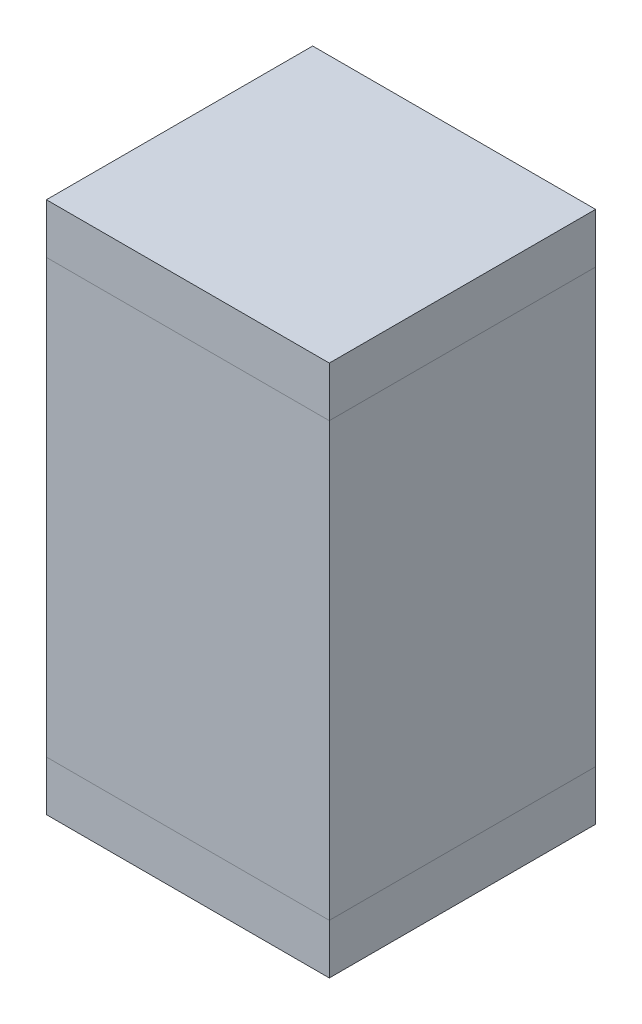
ISO-10303-21;
HEADER;
FILE_DESCRIPTION(('STEP AP214'),'2;1');
FILE_NAME('part.step','',(''),(''),'','','');
FILE_SCHEMA(('AUTOMOTIVE_DESIGN { 1 0 10303 214 1 1 1 1 }'));
ENDSEC;
DATA;
#1=APPLICATION_CONTEXT('core data for automotive mechanical design processes');
#2=APPLICATION_PROTOCOL_DEFINITION('international standard','automotive_design',2000,#1);
#3=PRODUCT_CONTEXT('',#1,'mechanical');
#4=PRODUCT('Part','Part','',(#3));
#5=PRODUCT_RELATED_PRODUCT_CATEGORY('part','',(#4));
#6=PRODUCT_DEFINITION_FORMATION('','',#4);
#7=PRODUCT_DEFINITION_CONTEXT('part definition',#1,'design');
#8=PRODUCT_DEFINITION('design','',#6,#7);
#9=PRODUCT_DEFINITION_SHAPE('','',#8);
#10=(LENGTH_UNIT() NAMED_UNIT(*) SI_UNIT(.MILLI.,.METRE.));
#11=(NAMED_UNIT(*) PLANE_ANGLE_UNIT() SI_UNIT($,.RADIAN.));
#12=(NAMED_UNIT(*) SI_UNIT($,.STERADIAN.) SOLID_ANGLE_UNIT());
#13=UNCERTAINTY_MEASURE_WITH_UNIT(LENGTH_MEASURE(1.E-05),#10,'distance_accuracy_value','');
#14=(GEOMETRIC_REPRESENTATION_CONTEXT(3) GLOBAL_UNCERTAINTY_ASSIGNED_CONTEXT((#13)) GLOBAL_UNIT_ASSIGNED_CONTEXT((#10,
#11,#12)) REPRESENTATION_CONTEXT('',''));
#15=CARTESIAN_POINT('',(0.,0.,0.));
#16=DIRECTION('',(0.,0.,1.));
#17=DIRECTION('',(1.,0.,0.));
#18=AXIS2_PLACEMENT_3D('',#15,#16,#17);
#19=CARTESIAN_POINT('',(0.,0.,0.));
#20=DIRECTION('',(0.,0.,1.));
#21=DIRECTION('',(1.,0.,0.));
#22=AXIS2_PLACEMENT_3D('',#19,#20,#21);
#23=PLANE('',#22);
#24=DIRECTION('',(1.,0.,0.));
#25=VECTOR('',#24,1.);
#26=CARTESIAN_POINT('',(-0.425,0.65,0.));
#27=LINE('',#26,#25);
#28=CARTESIAN_POINT('',(-0.425,0.65,0.));
#29=VERTEX_POINT('',#28);
#30=CARTESIAN_POINT('',(0.425,0.65,0.));
#31=VERTEX_POINT('',#30);
#32=EDGE_CURVE('P0_E20',#29,#31,#27,.T.);
#33=ORIENTED_EDGE('',*,*,#32,.T.);
#34=DIRECTION('',(0.,-1.,0.));
#35=VECTOR('',#34,1.);
#36=CARTESIAN_POINT('',(0.425,0.65,0.));
#37=LINE('',#36,#35);
#38=CARTESIAN_POINT('',(0.425,-0.65,0.));
#39=VERTEX_POINT('',#38);
#40=EDGE_CURVE('P0_E88',#31,#39,#37,.T.);
#41=ORIENTED_EDGE('',*,*,#40,.T.);
#42=DIRECTION('',(-1.,0.,0.));
#43=VECTOR('',#42,1.);
#44=CARTESIAN_POINT('',(0.425,-0.65,0.));
#45=LINE('',#44,#43);
#46=CARTESIAN_POINT('',(-0.425,-0.65,0.));
#47=VERTEX_POINT('',#46);
#48=EDGE_CURVE('P0_E70',#39,#47,#45,.T.);
#49=ORIENTED_EDGE('',*,*,#48,.T.);
#50=DIRECTION('',(0.,1.,0.));
#51=VECTOR('',#50,1.);
#52=CARTESIAN_POINT('',(-0.425,-0.65,0.));
#53=LINE('',#52,#51);
#54=EDGE_CURVE('P0_E109',#47,#29,#53,.T.);
#55=ORIENTED_EDGE('',*,*,#54,.T.);
#56=EDGE_LOOP('',(#33,#41,#49,#55));
#57=FACE_BOUND('',#56,.T.);
#58=ADVANCED_FACE('P0_F17',(#57),#23,.F.);
#59=CARTESIAN_POINT('',(0.,0.,0.8));
#60=DIRECTION('',(0.,0.,1.));
#61=DIRECTION('',(1.,0.,0.));
#62=AXIS2_PLACEMENT_3D('',#59,#60,#61);
#63=PLANE('',#62);
#64=DIRECTION('',(-1.,0.,0.));
#65=VECTOR('',#64,1.);
#66=CARTESIAN_POINT('',(-0.425,0.65,0.8));
#67=LINE('',#66,#65);
#68=CARTESIAN_POINT('',(0.425,0.65,0.8));
#69=VERTEX_POINT('',#68);
#70=CARTESIAN_POINT('',(-0.425,0.65,0.8));
#71=VERTEX_POINT('',#70);
#72=EDGE_CURVE('P0_E11',#69,#71,#67,.T.);
#73=ORIENTED_EDGE('',*,*,#72,.T.);
#74=DIRECTION('',(0.,-1.,0.));
#75=VECTOR('',#74,1.);
#76=CARTESIAN_POINT('',(-0.425,-0.65,0.8));
#77=LINE('',#76,#75);
#78=CARTESIAN_POINT('',(-0.425,-0.65,0.8));
#79=VERTEX_POINT('',#78);
#80=EDGE_CURVE('P0_E103',#71,#79,#77,.T.);
#81=ORIENTED_EDGE('',*,*,#80,.T.);
#82=DIRECTION('',(1.,0.,0.));
#83=VECTOR('',#82,1.);
#84=CARTESIAN_POINT('',(0.425,-0.65,0.8));
#85=LINE('',#84,#83);
#86=CARTESIAN_POINT('',(0.425,-0.65,0.8));
#87=VERTEX_POINT('',#86);
#88=EDGE_CURVE('P0_E82',#79,#87,#85,.T.);
#89=ORIENTED_EDGE('',*,*,#88,.T.);
#90=DIRECTION('',(0.,1.,0.));
#91=VECTOR('',#90,1.);
#92=CARTESIAN_POINT('',(0.425,0.65,0.8));
#93=LINE('',#92,#91);
#94=EDGE_CURVE('P0_E89',#87,#69,#93,.T.);
#95=ORIENTED_EDGE('',*,*,#94,.T.);
#96=EDGE_LOOP('',(#73,#81,#89,#95));
#97=FACE_BOUND('',#96,.T.);
#98=ADVANCED_FACE('P0_F118',(#97),#63,.T.);
#99=CARTESIAN_POINT('',(0.425,0.65,0.));
#100=DIRECTION('',(0.,1.,0.));
#101=DIRECTION('',(1.,0.,0.));
#102=AXIS2_PLACEMENT_3D('',#99,#100,#101);
#103=PLANE('',#102);
#104=ORIENTED_EDGE('',*,*,#32,.F.);
#105=DIRECTION('',(0.,0.,1.));
#106=VECTOR('',#105,1.);
#107=CARTESIAN_POINT('',(-0.425,0.65,0.));
#108=LINE('',#107,#106);
#109=EDGE_CURVE('P0_E101',#29,#71,#108,.T.);
#110=ORIENTED_EDGE('',*,*,#109,.T.);
#111=ORIENTED_EDGE('',*,*,#72,.F.);
#112=DIRECTION('',(0.,0.,1.));
#113=VECTOR('',#112,1.);
#114=CARTESIAN_POINT('',(0.425,0.65,0.));
#115=LINE('',#114,#113);
#116=EDGE_CURVE('P0_E93',#31,#69,#115,.T.);
#117=ORIENTED_EDGE('',*,*,#116,.F.);
#118=EDGE_LOOP('',(#104,#110,#111,#117));
#119=FACE_BOUND('',#118,.T.);
#120=ADVANCED_FACE('P0_F117',(#119),#103,.T.);
#121=CARTESIAN_POINT('',(-0.425,0.65,0.));
#122=DIRECTION('',(-1.,0.,0.));
#123=DIRECTION('',(0.,0.,1.));
#124=AXIS2_PLACEMENT_3D('',#121,#122,#123);
#125=PLANE('',#124);
#126=ORIENTED_EDGE('',*,*,#54,.F.);
#127=DIRECTION('',(0.,0.,1.));
#128=VECTOR('',#127,1.);
#129=CARTESIAN_POINT('',(-0.425,-0.65,0.));
#130=LINE('',#129,#128);
#131=EDGE_CURVE('P0_E77',#47,#79,#130,.T.);
#132=ORIENTED_EDGE('',*,*,#131,.T.);
#133=ORIENTED_EDGE('',*,*,#80,.F.);
#134=ORIENTED_EDGE('',*,*,#109,.F.);
#135=EDGE_LOOP('',(#126,#132,#133,#134));
#136=FACE_BOUND('',#135,.T.);
#137=ADVANCED_FACE('P0_F115',(#136),#125,.T.);
#138=CARTESIAN_POINT('',(-0.425,-0.65,0.));
#139=DIRECTION('',(0.,-1.,0.));
#140=DIRECTION('',(0.,0.,-1.));
#141=AXIS2_PLACEMENT_3D('',#138,#139,#140);
#142=PLANE('',#141);
#143=ORIENTED_EDGE('',*,*,#48,.F.);
#144=DIRECTION('',(0.,0.,1.));
#145=VECTOR('',#144,1.);
#146=CARTESIAN_POINT('',(0.425,-0.65,0.));
#147=LINE('',#146,#145);
#148=EDGE_CURVE('P0_E74',#39,#87,#147,.T.);
#149=ORIENTED_EDGE('',*,*,#148,.T.);
#150=ORIENTED_EDGE('',*,*,#88,.F.);
#151=ORIENTED_EDGE('',*,*,#131,.F.);
#152=EDGE_LOOP('',(#143,#149,#150,#151));
#153=FACE_BOUND('',#152,.T.);
#154=ADVANCED_FACE('P0_F72',(#153),#142,.T.);
#155=CARTESIAN_POINT('',(0.425,-0.65,0.));
#156=DIRECTION('',(1.,0.,0.));
#157=DIRECTION('',(0.,1.,0.));
#158=AXIS2_PLACEMENT_3D('',#155,#156,#157);
#159=PLANE('',#158);
#160=ORIENTED_EDGE('',*,*,#40,.F.);
#161=ORIENTED_EDGE('',*,*,#116,.T.);
#162=ORIENTED_EDGE('',*,*,#94,.F.);
#163=ORIENTED_EDGE('',*,*,#148,.F.);
#164=EDGE_LOOP('',(#160,#161,#162,#163));
#165=FACE_BOUND('',#164,.T.);
#166=ADVANCED_FACE('P0_F86',(#165),#159,.T.);
#167=CLOSED_SHELL('',(#58,#98,#120,#137,#154,#166));
#168=MANIFOLD_SOLID_BREP('P0_B1',#167);
#169=CARTESIAN_POINT('',(0.425,0.65,0.));
#170=DIRECTION('',(0.,1.,0.));
#171=DIRECTION('',(1.,0.,0.));
#172=AXIS2_PLACEMENT_3D('',#169,#170,#171);
#173=PLANE('',#172);
#174=DIRECTION('',(1.,0.,0.));
#175=VECTOR('',#174,1.);
#176=CARTESIAN_POINT('',(-0.425,0.65,0.));
#177=LINE('',#176,#175);
#178=CARTESIAN_POINT('',(-0.425,0.65,0.));
#179=VERTEX_POINT('',#178);
#180=CARTESIAN_POINT('',(0.425,0.65,0.));
#181=VERTEX_POINT('',#180);
#182=EDGE_CURVE('P1_E26',#179,#181,#177,.T.);
#183=ORIENTED_EDGE('',*,*,#182,.T.);
#184=DIRECTION('',(0.,0.,1.));
#185=VECTOR('',#184,1.);
#186=CARTESIAN_POINT('',(0.425,0.65,0.));
#187=LINE('',#186,#185);
#188=CARTESIAN_POINT('',(0.425,0.65,0.8));
#189=VERTEX_POINT('',#188);
#190=EDGE_CURVE('P1_E91',#181,#189,#187,.T.);
#191=ORIENTED_EDGE('',*,*,#190,.T.);
#192=DIRECTION('',(-1.,0.,0.));
#193=VECTOR('',#192,1.);
#194=CARTESIAN_POINT('',(-0.425,0.65,0.8));
#195=LINE('',#194,#193);
#196=CARTESIAN_POINT('',(-0.425,0.65,0.8));
#197=VERTEX_POINT('',#196);
#198=EDGE_CURVE('P1_E77',#189,#197,#195,.T.);
#199=ORIENTED_EDGE('',*,*,#198,.T.);
#200=DIRECTION('',(0.,0.,1.));
#201=VECTOR('',#200,1.);
#202=CARTESIAN_POINT('',(-0.425,0.65,0.));
#203=LINE('',#202,#201);
#204=EDGE_CURVE('P1_E56',#179,#197,#203,.T.);
#205=ORIENTED_EDGE('',*,*,#204,.F.);
#206=EDGE_LOOP('',(#183,#191,#199,#205));
#207=FACE_BOUND('',#206,.T.);
#208=ADVANCED_FACE('P1_F17',(#207),#173,.F.);
#209=CARTESIAN_POINT('',(0.425,0.8,0.));
#210=DIRECTION('',(0.,1.,0.));
#211=DIRECTION('',(1.,0.,0.));
#212=AXIS2_PLACEMENT_3D('',#209,#210,#211);
#213=PLANE('',#212);
#214=DIRECTION('',(-1.,0.,0.));
#215=VECTOR('',#214,1.);
#216=CARTESIAN_POINT('',(-0.425,0.8,0.));
#217=LINE('',#216,#215);
#218=CARTESIAN_POINT('',(0.425,0.8,0.));
#219=VERTEX_POINT('',#218);
#220=CARTESIAN_POINT('',(-0.425,0.8,0.));
#221=VERTEX_POINT('',#220);
#222=EDGE_CURVE('P1_E11',#219,#221,#217,.T.);
#223=ORIENTED_EDGE('',*,*,#222,.T.);
#224=DIRECTION('',(0.,0.,1.));
#225=VECTOR('',#224,1.);
#226=CARTESIAN_POINT('',(-0.425,0.8,0.));
#227=LINE('',#226,#225);
#228=CARTESIAN_POINT('',(-0.425,0.8,0.8));
#229=VERTEX_POINT('',#228);
#230=EDGE_CURVE('P1_E47',#221,#229,#227,.T.);
#231=ORIENTED_EDGE('',*,*,#230,.T.);
#232=DIRECTION('',(1.,0.,0.));
#233=VECTOR('',#232,1.);
#234=CARTESIAN_POINT('',(-0.425,0.8,0.8));
#235=LINE('',#234,#233);
#236=CARTESIAN_POINT('',(0.425,0.8,0.8));
#237=VERTEX_POINT('',#236);
#238=EDGE_CURVE('P1_E65',#229,#237,#235,.T.);
#239=ORIENTED_EDGE('',*,*,#238,.T.);
#240=DIRECTION('',(0.,0.,-1.));
#241=VECTOR('',#240,1.);
#242=CARTESIAN_POINT('',(0.425,0.8,0.));
#243=LINE('',#242,#241);
#244=EDGE_CURVE('P1_E92',#237,#219,#243,.T.);
#245=ORIENTED_EDGE('',*,*,#244,.T.);
#246=EDGE_LOOP('',(#223,#231,#239,#245));
#247=FACE_BOUND('',#246,.T.);
#248=ADVANCED_FACE('P1_F144',(#247),#213,.T.);
#249=CARTESIAN_POINT('',(0.425,0.65,0.));
#250=DIRECTION('',(0.,0.,-1.));
#251=DIRECTION('',(0.,-1.,0.));
#252=AXIS2_PLACEMENT_3D('',#249,#250,#251);
#253=PLANE('',#252);
#254=ORIENTED_EDGE('',*,*,#182,.F.);
#255=DIRECTION('',(0.,1.,0.));
#256=VECTOR('',#255,1.);
#257=CARTESIAN_POINT('',(-0.425,0.65,0.));
#258=LINE('',#257,#256);
#259=EDGE_CURVE('P1_E105',#179,#221,#258,.T.);
#260=ORIENTED_EDGE('',*,*,#259,.T.);
#261=ORIENTED_EDGE('',*,*,#222,.F.);
#262=DIRECTION('',(0.,1.,0.));
#263=VECTOR('',#262,1.);
#264=CARTESIAN_POINT('',(0.425,0.65,0.));
#265=LINE('',#264,#263);
#266=EDGE_CURVE('P1_E97',#181,#219,#265,.T.);
#267=ORIENTED_EDGE('',*,*,#266,.F.);
#268=EDGE_LOOP('',(#254,#260,#261,#267));
#269=FACE_BOUND('',#268,.T.);
#270=ADVANCED_FACE('P1_F139',(#269),#253,.T.);
#271=CARTESIAN_POINT('',(-0.425,0.65,0.));
#272=DIRECTION('',(-1.,0.,0.));
#273=DIRECTION('',(0.,0.,1.));
#274=AXIS2_PLACEMENT_3D('',#271,#272,#273);
#275=PLANE('',#274);
#276=ORIENTED_EDGE('',*,*,#204,.T.);
#277=DIRECTION('',(0.,1.,0.));
#278=VECTOR('',#277,1.);
#279=CARTESIAN_POINT('',(-0.425,0.65,0.8));
#280=LINE('',#279,#278);
#281=EDGE_CURVE('P1_E82',#197,#229,#280,.T.);
#282=ORIENTED_EDGE('',*,*,#281,.T.);
#283=ORIENTED_EDGE('',*,*,#230,.F.);
#284=ORIENTED_EDGE('',*,*,#259,.F.);
#285=EDGE_LOOP('',(#276,#282,#283,#284));
#286=FACE_BOUND('',#285,.T.);
#287=ADVANCED_FACE('P1_F132',(#286),#275,.T.);
#288=CARTESIAN_POINT('',(-0.425,0.65,0.8));
#289=DIRECTION('',(0.,0.,1.));
#290=DIRECTION('',(1.,0.,0.));
#291=AXIS2_PLACEMENT_3D('',#288,#289,#290);
#292=PLANE('',#291);
#293=ORIENTED_EDGE('',*,*,#198,.F.);
#294=DIRECTION('',(0.,1.,0.));
#295=VECTOR('',#294,1.);
#296=CARTESIAN_POINT('',(0.425,0.65,0.8));
#297=LINE('',#296,#295);
#298=EDGE_CURVE('P1_E80',#189,#237,#297,.T.);
#299=ORIENTED_EDGE('',*,*,#298,.T.);
#300=ORIENTED_EDGE('',*,*,#238,.F.);
#301=ORIENTED_EDGE('',*,*,#281,.F.);
#302=EDGE_LOOP('',(#293,#299,#300,#301));
#303=FACE_BOUND('',#302,.T.);
#304=ADVANCED_FACE('P1_F79',(#303),#292,.T.);
#305=CARTESIAN_POINT('',(0.425,0.65,0.8));
#306=DIRECTION('',(1.,0.,0.));
#307=DIRECTION('',(0.,1.,0.));
#308=AXIS2_PLACEMENT_3D('',#305,#306,#307);
#309=PLANE('',#308);
#310=ORIENTED_EDGE('',*,*,#190,.F.);
#311=ORIENTED_EDGE('',*,*,#266,.T.);
#312=ORIENTED_EDGE('',*,*,#244,.F.);
#313=ORIENTED_EDGE('',*,*,#298,.F.);
#314=EDGE_LOOP('',(#310,#311,#312,#313));
#315=FACE_BOUND('',#314,.T.);
#316=ADVANCED_FACE('P1_F89',(#315),#309,.T.);
#317=CLOSED_SHELL('',(#208,#248,#270,#287,#304,#316));
#318=MANIFOLD_SOLID_BREP('P1_B1',#317);
#319=CARTESIAN_POINT('',(-0.425,-0.65,0.));
#320=DIRECTION('',(0.,-1.,0.));
#321=DIRECTION('',(0.,0.,-1.));
#322=AXIS2_PLACEMENT_3D('',#319,#320,#321);
#323=PLANE('',#322);
#324=DIRECTION('',(-1.,0.,0.));
#325=VECTOR('',#324,1.);
#326=CARTESIAN_POINT('',(0.425,-0.65,0.));
#327=LINE('',#326,#325);
#328=CARTESIAN_POINT('',(0.425,-0.65,0.));
#329=VERTEX_POINT('',#328);
#330=CARTESIAN_POINT('',(-0.425,-0.65,0.));
#331=VERTEX_POINT('',#330);
#332=EDGE_CURVE('P2_E27',#329,#331,#327,.T.);
#333=ORIENTED_EDGE('',*,*,#332,.T.);
#334=DIRECTION('',(0.,0.,1.));
#335=VECTOR('',#334,1.);
#336=CARTESIAN_POINT('',(-0.425,-0.65,0.));
#337=LINE('',#336,#335);
#338=CARTESIAN_POINT('',(-0.425,-0.65,0.8));
#339=VERTEX_POINT('',#338);
#340=EDGE_CURVE('P2_E102',#331,#339,#337,.T.);
#341=ORIENTED_EDGE('',*,*,#340,.T.);
#342=DIRECTION('',(1.,0.,0.));
#343=VECTOR('',#342,1.);
#344=CARTESIAN_POINT('',(0.425,-0.65,0.8));
#345=LINE('',#344,#343);
#346=CARTESIAN_POINT('',(0.425,-0.65,0.8));
#347=VERTEX_POINT('',#346);
#348=EDGE_CURVE('P2_E89',#339,#347,#345,.T.);
#349=ORIENTED_EDGE('',*,*,#348,.T.);
#350=DIRECTION('',(0.,0.,1.));
#351=VECTOR('',#350,1.);
#352=CARTESIAN_POINT('',(0.425,-0.65,0.));
#353=LINE('',#352,#351);
#354=EDGE_CURVE('P2_E65',#329,#347,#353,.T.);
#355=ORIENTED_EDGE('',*,*,#354,.F.);
#356=EDGE_LOOP('',(#333,#341,#349,#355));
#357=FACE_BOUND('',#356,.T.);
#358=ADVANCED_FACE('P2_F17',(#357),#323,.F.);
#359=CARTESIAN_POINT('',(-0.425,-0.8,0.));
#360=DIRECTION('',(0.,-1.,0.));
#361=DIRECTION('',(0.,0.,-1.));
#362=AXIS2_PLACEMENT_3D('',#359,#360,#361);
#363=PLANE('',#362);
#364=DIRECTION('',(1.,0.,0.));
#365=VECTOR('',#364,1.);
#366=CARTESIAN_POINT('',(0.425,-0.8,0.));
#367=LINE('',#366,#365);
#368=CARTESIAN_POINT('',(-0.425,-0.8,0.));
#369=VERTEX_POINT('',#368);
#370=CARTESIAN_POINT('',(0.425,-0.8,0.));
#371=VERTEX_POINT('',#370);
#372=EDGE_CURVE('P2_E11',#369,#371,#367,.T.);
#373=ORIENTED_EDGE('',*,*,#372,.T.);
#374=DIRECTION('',(0.,0.,1.));
#375=VECTOR('',#374,1.);
#376=CARTESIAN_POINT('',(0.425,-0.8,0.));
#377=LINE('',#376,#375);
#378=CARTESIAN_POINT('',(0.425,-0.8,0.8));
#379=VERTEX_POINT('',#378);
#380=EDGE_CURVE('P2_E71',#371,#379,#377,.T.);
#381=ORIENTED_EDGE('',*,*,#380,.T.);
#382=DIRECTION('',(-1.,0.,0.));
#383=VECTOR('',#382,1.);
#384=CARTESIAN_POINT('',(0.425,-0.8,0.8));
#385=LINE('',#384,#383);
#386=CARTESIAN_POINT('',(-0.425,-0.8,0.8));
#387=VERTEX_POINT('',#386);
#388=EDGE_CURVE('P2_E73',#379,#387,#385,.T.);
#389=ORIENTED_EDGE('',*,*,#388,.T.);
#390=DIRECTION('',(0.,0.,-1.));
#391=VECTOR('',#390,1.);
#392=CARTESIAN_POINT('',(-0.425,-0.8,0.));
#393=LINE('',#392,#391);
#394=EDGE_CURVE('P2_E109',#387,#369,#393,.T.);
#395=ORIENTED_EDGE('',*,*,#394,.T.);
#396=EDGE_LOOP('',(#373,#381,#389,#395));
#397=FACE_BOUND('',#396,.T.);
#398=ADVANCED_FACE('P2_F19',(#397),#363,.T.);
#399=CARTESIAN_POINT('',(-0.425,-0.65,0.));
#400=DIRECTION('',(0.,0.,-1.));
#401=DIRECTION('',(0.,-1.,0.));
#402=AXIS2_PLACEMENT_3D('',#399,#400,#401);
#403=PLANE('',#402);
#404=ORIENTED_EDGE('',*,*,#332,.F.);
#405=DIRECTION('',(0.,-1.,0.));
#406=VECTOR('',#405,1.);
#407=CARTESIAN_POINT('',(0.425,-0.65,0.));
#408=LINE('',#407,#406);
#409=EDGE_CURVE('P2_E76',#329,#371,#408,.T.);
#410=ORIENTED_EDGE('',*,*,#409,.T.);
#411=ORIENTED_EDGE('',*,*,#372,.F.);
#412=DIRECTION('',(0.,-1.,0.));
#413=VECTOR('',#412,1.);
#414=CARTESIAN_POINT('',(-0.425,-0.65,0.));
#415=LINE('',#414,#413);
#416=EDGE_CURVE('P2_E105',#331,#369,#415,.T.);
#417=ORIENTED_EDGE('',*,*,#416,.F.);
#418=EDGE_LOOP('',(#404,#410,#411,#417));
#419=FACE_BOUND('',#418,.T.);
#420=ADVANCED_FACE('P2_F106',(#419),#403,.T.);
#421=CARTESIAN_POINT('',(0.425,-0.65,0.));
#422=DIRECTION('',(1.,0.,0.));
#423=DIRECTION('',(0.,1.,0.));
#424=AXIS2_PLACEMENT_3D('',#421,#422,#423);
#425=PLANE('',#424);
#426=ORIENTED_EDGE('',*,*,#354,.T.);
#427=DIRECTION('',(0.,-1.,0.));
#428=VECTOR('',#427,1.);
#429=CARTESIAN_POINT('',(0.425,-0.65,0.8));
#430=LINE('',#429,#428);
#431=EDGE_CURVE('P2_E78',#347,#379,#430,.T.);
#432=ORIENTED_EDGE('',*,*,#431,.T.);
#433=ORIENTED_EDGE('',*,*,#380,.F.);
#434=ORIENTED_EDGE('',*,*,#409,.F.);
#435=EDGE_LOOP('',(#426,#432,#433,#434));
#436=FACE_BOUND('',#435,.T.);
#437=ADVANCED_FACE('P2_F79',(#436),#425,.T.);
#438=CARTESIAN_POINT('',(0.425,-0.65,0.8));
#439=DIRECTION('',(0.,0.,1.));
#440=DIRECTION('',(1.,0.,0.));
#441=AXIS2_PLACEMENT_3D('',#438,#439,#440);
#442=PLANE('',#441);
#443=ORIENTED_EDGE('',*,*,#348,.F.);
#444=DIRECTION('',(0.,-1.,0.));
#445=VECTOR('',#444,1.);
#446=CARTESIAN_POINT('',(-0.425,-0.65,0.8));
#447=LINE('',#446,#445);
#448=EDGE_CURVE('P2_E86',#339,#387,#447,.T.);
#449=ORIENTED_EDGE('',*,*,#448,.T.);
#450=ORIENTED_EDGE('',*,*,#388,.F.);
#451=ORIENTED_EDGE('',*,*,#431,.F.);
#452=EDGE_LOOP('',(#443,#449,#450,#451));
#453=FACE_BOUND('',#452,.T.);
#454=ADVANCED_FACE('P2_F84',(#453),#442,.T.);
#455=CARTESIAN_POINT('',(-0.425,-0.65,0.8));
#456=DIRECTION('',(-1.,0.,0.));
#457=DIRECTION('',(0.,0.,1.));
#458=AXIS2_PLACEMENT_3D('',#455,#456,#457);
#459=PLANE('',#458);
#460=ORIENTED_EDGE('',*,*,#340,.F.);
#461=ORIENTED_EDGE('',*,*,#416,.T.);
#462=ORIENTED_EDGE('',*,*,#394,.F.);
#463=ORIENTED_EDGE('',*,*,#448,.F.);
#464=EDGE_LOOP('',(#460,#461,#462,#463));
#465=FACE_BOUND('',#464,.T.);
#466=ADVANCED_FACE('P2_F111',(#465),#459,.T.);
#467=CLOSED_SHELL('',(#358,#398,#420,#437,#454,#466));
#468=MANIFOLD_SOLID_BREP('P2_B1',#467);
#469=ADVANCED_BREP_SHAPE_REPRESENTATION('',(#18,#168,#318,#468),#14);
#470=SHAPE_DEFINITION_REPRESENTATION(#9,#469);
ENDSEC;
END-ISO-10303-21;
